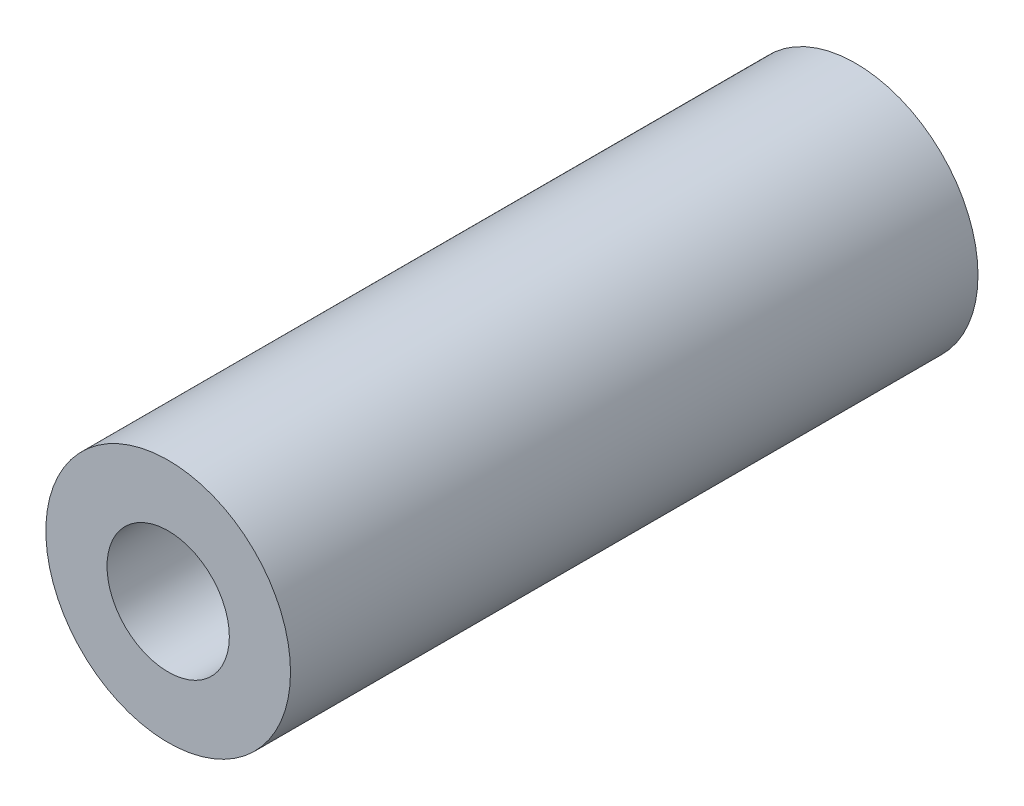
ISO-10303-21;
HEADER;
FILE_DESCRIPTION(('STEP AP214'),'2;1');
FILE_NAME('part.step','',(''),(''),'','','');
FILE_SCHEMA(('AUTOMOTIVE_DESIGN { 1 0 10303 214 1 1 1 1 }'));
ENDSEC;
DATA;
#1=APPLICATION_CONTEXT('core data for automotive mechanical design processes');
#2=APPLICATION_PROTOCOL_DEFINITION('international standard','automotive_design',2000,#1);
#3=PRODUCT_CONTEXT('',#1,'mechanical');
#4=PRODUCT('Part','Part','',(#3));
#5=PRODUCT_RELATED_PRODUCT_CATEGORY('part','',(#4));
#6=PRODUCT_DEFINITION_FORMATION('','',#4);
#7=PRODUCT_DEFINITION_CONTEXT('part definition',#1,'design');
#8=PRODUCT_DEFINITION('design','',#6,#7);
#9=PRODUCT_DEFINITION_SHAPE('','',#8);
#10=(LENGTH_UNIT() NAMED_UNIT(*) SI_UNIT(.MILLI.,.METRE.));
#11=(NAMED_UNIT(*) PLANE_ANGLE_UNIT() SI_UNIT($,.RADIAN.));
#12=(NAMED_UNIT(*) SI_UNIT($,.STERADIAN.) SOLID_ANGLE_UNIT());
#13=UNCERTAINTY_MEASURE_WITH_UNIT(LENGTH_MEASURE(1.E-05),#10,'distance_accuracy_value','');
#14=(GEOMETRIC_REPRESENTATION_CONTEXT(3) GLOBAL_UNCERTAINTY_ASSIGNED_CONTEXT((#13)) GLOBAL_UNIT_ASSIGNED_CONTEXT((#10,
#11,#12)) REPRESENTATION_CONTEXT('',''));
#15=CARTESIAN_POINT('',(0.,0.,0.));
#16=DIRECTION('',(0.,0.,1.));
#17=DIRECTION('',(1.,0.,0.));
#18=AXIS2_PLACEMENT_3D('',#15,#16,#17);
#19=CARTESIAN_POINT('',(0.,0.,71.374));
#20=DIRECTION('',(0.,0.,1.));
#21=DIRECTION('',(1.,0.,0.));
#22=AXIS2_PLACEMENT_3D('',#19,#20,#21);
#23=PLANE('',#22);
#24=CARTESIAN_POINT('',(0.,0.,71.374));
#25=DIRECTION('',(0.,0.,1.));
#26=DIRECTION('',(1.,0.,0.));
#27=AXIS2_PLACEMENT_3D('',#24,#25,#26);
#28=CIRCLE('',#27,12.7);
#29=CARTESIAN_POINT('',(12.7,0.,71.374));
#30=VERTEX_POINT('',#29);
#31=EDGE_CURVE('E10',#30,#30,#28,.T.);
#32=ORIENTED_EDGE('',*,*,#31,.T.);
#33=EDGE_LOOP('',(#32));
#34=FACE_BOUND('',#33,.T.);
#35=CARTESIAN_POINT('',(0.,0.,71.374));
#36=DIRECTION('',(0.,0.,1.));
#37=DIRECTION('',(1.,0.,0.));
#38=AXIS2_PLACEMENT_3D('',#35,#36,#37);
#39=CIRCLE('',#38,6.35);
#40=CARTESIAN_POINT('',(6.35,0.,71.374));
#41=VERTEX_POINT('',#40);
#42=EDGE_CURVE('E40',#41,#41,#39,.T.);
#43=ORIENTED_EDGE('',*,*,#42,.F.);
#44=EDGE_LOOP('',(#43));
#45=FACE_BOUND('',#44,.T.);
#46=ADVANCED_FACE('F29',(#34,#45),#23,.T.);
#47=CARTESIAN_POINT('',(0.,0.,0.));
#48=DIRECTION('',(0.,0.,1.));
#49=DIRECTION('',(1.,0.,0.));
#50=AXIS2_PLACEMENT_3D('',#47,#48,#49);
#51=PLANE('',#50);
#52=CARTESIAN_POINT('',(0.,0.,0.));
#53=DIRECTION('',(0.,0.,1.));
#54=DIRECTION('',(1.,0.,0.));
#55=AXIS2_PLACEMENT_3D('',#52,#53,#54);
#56=CIRCLE('',#55,12.7);
#57=CARTESIAN_POINT('',(12.7,0.,0.));
#58=VERTEX_POINT('',#57);
#59=EDGE_CURVE('E33',#58,#58,#56,.T.);
#60=ORIENTED_EDGE('',*,*,#59,.F.);
#61=EDGE_LOOP('',(#60));
#62=FACE_BOUND('',#61,.T.);
#63=CARTESIAN_POINT('',(0.,0.,0.));
#64=DIRECTION('',(0.,0.,1.));
#65=DIRECTION('',(1.,0.,0.));
#66=AXIS2_PLACEMENT_3D('',#63,#64,#65);
#67=CIRCLE('',#66,6.35);
#68=CARTESIAN_POINT('',(6.35,0.,0.));
#69=VERTEX_POINT('',#68);
#70=EDGE_CURVE('E42',#69,#69,#67,.T.);
#71=ORIENTED_EDGE('',*,*,#70,.T.);
#72=EDGE_LOOP('',(#71));
#73=FACE_BOUND('',#72,.T.);
#74=ADVANCED_FACE('F52',(#62,#73),#51,.F.);
#75=CARTESIAN_POINT('',(0.,0.,71.374));
#76=DIRECTION('',(0.,0.,-1.));
#77=DIRECTION('',(-1.,0.,0.));
#78=AXIS2_PLACEMENT_3D('',#75,#76,#77);
#79=CYLINDRICAL_SURFACE('',#78,12.7);
#80=ORIENTED_EDGE('',*,*,#31,.F.);
#81=EDGE_LOOP('',(#80));
#82=FACE_BOUND('',#81,.T.);
#83=ORIENTED_EDGE('',*,*,#59,.T.);
#84=EDGE_LOOP('',(#83));
#85=FACE_BOUND('',#84,.T.);
#86=ADVANCED_FACE('F31',(#82,#85),#79,.T.);
#87=CARTESIAN_POINT('',(0.,0.,71.374));
#88=DIRECTION('',(0.,0.,-1.));
#89=DIRECTION('',(-1.,0.,0.));
#90=AXIS2_PLACEMENT_3D('',#87,#88,#89);
#91=CYLINDRICAL_SURFACE('',#90,6.35);
#92=ORIENTED_EDGE('',*,*,#42,.T.);
#93=EDGE_LOOP('',(#92));
#94=FACE_BOUND('',#93,.T.);
#95=ORIENTED_EDGE('',*,*,#70,.F.);
#96=EDGE_LOOP('',(#95));
#97=FACE_BOUND('',#96,.T.);
#98=ADVANCED_FACE('F48',(#94,#97),#91,.F.);
#99=CLOSED_SHELL('',(#46,#74,#86,#98));
#100=MANIFOLD_SOLID_BREP('B2',#99);
#101=ADVANCED_BREP_SHAPE_REPRESENTATION('',(#18,#100),#14);
#102=SHAPE_DEFINITION_REPRESENTATION(#9,#101);
ENDSEC;
END-ISO-10303-21;
